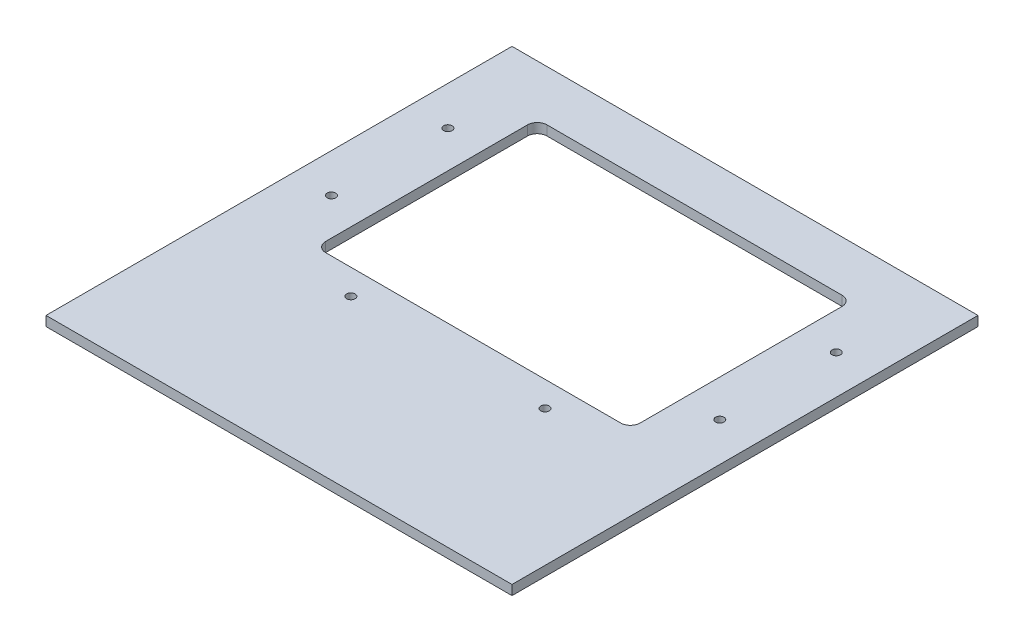
ISO-10303-21;
HEADER;
FILE_DESCRIPTION(('STEP AP214'),'2;1');
FILE_NAME('part.step','',(''),(''),'','','');
FILE_SCHEMA(('AUTOMOTIVE_DESIGN { 1 0 10303 214 1 1 1 1 }'));
ENDSEC;
DATA;
#1=APPLICATION_CONTEXT('core data for automotive mechanical design processes');
#2=APPLICATION_PROTOCOL_DEFINITION('international standard','automotive_design',2000,#1);
#3=PRODUCT_CONTEXT('',#1,'mechanical');
#4=PRODUCT('Part','Part','',(#3));
#5=PRODUCT_RELATED_PRODUCT_CATEGORY('part','',(#4));
#6=PRODUCT_DEFINITION_FORMATION('','',#4);
#7=PRODUCT_DEFINITION_CONTEXT('part definition',#1,'design');
#8=PRODUCT_DEFINITION('design','',#6,#7);
#9=PRODUCT_DEFINITION_SHAPE('','',#8);
#10=(LENGTH_UNIT() NAMED_UNIT(*) SI_UNIT(.MILLI.,.METRE.));
#11=(NAMED_UNIT(*) PLANE_ANGLE_UNIT() SI_UNIT($,.RADIAN.));
#12=(NAMED_UNIT(*) SI_UNIT($,.STERADIAN.) SOLID_ANGLE_UNIT());
#13=UNCERTAINTY_MEASURE_WITH_UNIT(LENGTH_MEASURE(1.E-05),#10,'distance_accuracy_value','');
#14=(GEOMETRIC_REPRESENTATION_CONTEXT(3) GLOBAL_UNCERTAINTY_ASSIGNED_CONTEXT((#13)) GLOBAL_UNIT_ASSIGNED_CONTEXT((#10,
#11,#12)) REPRESENTATION_CONTEXT('',''));
#15=CARTESIAN_POINT('',(0.,0.,0.));
#16=DIRECTION('',(0.,0.,1.));
#17=DIRECTION('',(1.,0.,0.));
#18=AXIS2_PLACEMENT_3D('',#15,#16,#17);
#19=CARTESIAN_POINT('',(0.,3.175,0.));
#20=DIRECTION('',(0.,1.,0.));
#21=DIRECTION('',(0.,0.,1.));
#22=AXIS2_PLACEMENT_3D('',#19,#20,#21);
#23=PLANE('',#22);
#24=CARTESIAN_POINT('',(-127.,3.175,-8.88999999999992));
#25=DIRECTION('',(0.,1.,0.));
#26=DIRECTION('',(0.,0.,1.));
#27=AXIS2_PLACEMENT_3D('',#24,#25,#26);
#28=CIRCLE('',#27,2.778125);
#29=CARTESIAN_POINT('',(-127.,3.175,-6.11187499999992));
#30=VERTEX_POINT('',#29);
#31=EDGE_CURVE('E322',#30,#30,#28,.T.);
#32=ORIENTED_EDGE('',*,*,#31,.F.);
#33=EDGE_LOOP('',(#32));
#34=FACE_BOUND('',#33,.T.);
#35=CARTESIAN_POINT('',(127.,3.175,-8.88999999999992));
#36=DIRECTION('',(0.,1.,0.));
#37=DIRECTION('',(0.,0.,1.));
#38=AXIS2_PLACEMENT_3D('',#35,#36,#37);
#39=CIRCLE('',#38,2.77812499999999);
#40=CARTESIAN_POINT('',(127.,3.175,-6.11187499999994));
#41=VERTEX_POINT('',#40);
#42=EDGE_CURVE('E334',#41,#41,#39,.T.);
#43=ORIENTED_EDGE('',*,*,#42,.F.);
#44=EDGE_LOOP('',(#43));
#45=FACE_BOUND('',#44,.T.);
#46=CARTESIAN_POINT('',(-63.5,3.175,41.9100000000001));
#47=DIRECTION('',(0.,1.,0.));
#48=DIRECTION('',(0.,0.,1.));
#49=AXIS2_PLACEMENT_3D('',#46,#47,#48);
#50=CIRCLE('',#49,2.778125);
#51=CARTESIAN_POINT('',(-63.5,3.175,44.6881250000001));
#52=VERTEX_POINT('',#51);
#53=EDGE_CURVE('E160',#52,#52,#50,.T.);
#54=ORIENTED_EDGE('',*,*,#53,.F.);
#55=EDGE_LOOP('',(#54));
#56=FACE_BOUND('',#55,.T.);
#57=DIRECTION('',(0.,0.,-1.));
#58=VECTOR('',#57,1.);
#59=CARTESIAN_POINT('',(152.4,3.175,-152.4));
#60=LINE('',#59,#58);
#61=CARTESIAN_POINT('',(152.4,3.175,152.4));
#62=VERTEX_POINT('',#61);
#63=CARTESIAN_POINT('',(152.4,3.175,-152.4));
#64=VERTEX_POINT('',#63);
#65=EDGE_CURVE('E190',#62,#64,#60,.T.);
#66=ORIENTED_EDGE('',*,*,#65,.T.);
#67=DIRECTION('',(-1.,0.,0.));
#68=VECTOR('',#67,1.);
#69=CARTESIAN_POINT('',(-152.4,3.175,-152.4));
#70=LINE('',#69,#68);
#71=CARTESIAN_POINT('',(-152.4,3.175,-152.4));
#72=VERTEX_POINT('',#71);
#73=EDGE_CURVE('E193',#64,#72,#70,.T.);
#74=ORIENTED_EDGE('',*,*,#73,.T.);
#75=DIRECTION('',(0.,0.,1.));
#76=VECTOR('',#75,1.);
#77=CARTESIAN_POINT('',(-152.4,3.175,-152.4));
#78=LINE('',#77,#76);
#79=CARTESIAN_POINT('',(-152.4,3.175,152.4));
#80=VERTEX_POINT('',#79);
#81=EDGE_CURVE('E196',#72,#80,#78,.T.);
#82=ORIENTED_EDGE('',*,*,#81,.T.);
#83=DIRECTION('',(1.,0.,0.));
#84=VECTOR('',#83,1.);
#85=CARTESIAN_POINT('',(-152.4,3.175,152.4));
#86=LINE('',#85,#84);
#87=EDGE_CURVE('E198',#80,#62,#86,.T.);
#88=ORIENTED_EDGE('',*,*,#87,.T.);
#89=EDGE_LOOP('',(#66,#74,#82,#88));
#90=FACE_BOUND('',#89,.T.);
#91=DIRECTION('',(1.,0.,0.));
#92=VECTOR('',#91,1.);
#93=CARTESIAN_POINT('',(-96.5112438893781,3.175,25.4000000000001));
#94=LINE('',#93,#92);
#95=CARTESIAN_POINT('',(-96.5112438893781,3.175,25.4000000000001));
#96=VERTEX_POINT('',#95);
#97=CARTESIAN_POINT('',(96.5112438893781,3.175,25.4000000000001));
#98=VERTEX_POINT('',#97);
#99=EDGE_CURVE('E130',#96,#98,#94,.T.);
#100=ORIENTED_EDGE('',*,*,#99,.F.);
#101=CARTESIAN_POINT('',(-96.511243889378,3.175,19.0500000000001));
#102=DIRECTION('',(0.,1.,0.));
#103=DIRECTION('',(0.,0.,1.));
#104=AXIS2_PLACEMENT_3D('',#101,#102,#103);
#105=CIRCLE('',#104,6.35000000000004);
#106=CARTESIAN_POINT('',(-102.861243889378,3.175,19.0500000000001));
#107=VERTEX_POINT('',#106);
#108=EDGE_CURVE('E122',#107,#96,#105,.T.);
#109=ORIENTED_EDGE('',*,*,#108,.F.);
#110=DIRECTION('',(0.,0.,1.));
#111=VECTOR('',#110,1.);
#112=CARTESIAN_POINT('',(-102.861243889378,3.175,-113.03));
#113=LINE('',#112,#111);
#114=CARTESIAN_POINT('',(-102.861243889378,3.175,-113.03));
#115=VERTEX_POINT('',#114);
#116=EDGE_CURVE('E157',#115,#107,#113,.T.);
#117=ORIENTED_EDGE('',*,*,#116,.F.);
#118=CARTESIAN_POINT('',(-96.511243889378,3.175,-113.03));
#119=DIRECTION('',(0.,1.,0.));
#120=DIRECTION('',(0.,0.,1.));
#121=AXIS2_PLACEMENT_3D('',#118,#119,#120);
#122=CIRCLE('',#121,6.35000000000004);
#123=CARTESIAN_POINT('',(-96.5112438893781,3.175,-119.38));
#124=VERTEX_POINT('',#123);
#125=EDGE_CURVE('E155',#124,#115,#122,.T.);
#126=ORIENTED_EDGE('',*,*,#125,.F.);
#127=DIRECTION('',(-1.,0.,0.));
#128=VECTOR('',#127,1.);
#129=CARTESIAN_POINT('',(-96.5112438893781,3.175,-119.38));
#130=LINE('',#129,#128);
#131=CARTESIAN_POINT('',(96.5112438893781,3.175,-119.38));
#132=VERTEX_POINT('',#131);
#133=EDGE_CURVE('E153',#132,#124,#130,.T.);
#134=ORIENTED_EDGE('',*,*,#133,.F.);
#135=CARTESIAN_POINT('',(96.511243889378,3.175,-113.03));
#136=DIRECTION('',(0.,1.,0.));
#137=DIRECTION('',(0.,0.,-1.));
#138=AXIS2_PLACEMENT_3D('',#135,#136,#137);
#139=CIRCLE('',#138,6.35000000000004);
#140=CARTESIAN_POINT('',(102.861243889378,3.175,-113.03));
#141=VERTEX_POINT('',#140);
#142=EDGE_CURVE('E151',#141,#132,#139,.T.);
#143=ORIENTED_EDGE('',*,*,#142,.F.);
#144=DIRECTION('',(0.,0.,-1.));
#145=VECTOR('',#144,1.);
#146=CARTESIAN_POINT('',(102.861243889378,3.175,-113.03));
#147=LINE('',#146,#145);
#148=CARTESIAN_POINT('',(102.861243889378,3.175,19.0500000000001));
#149=VERTEX_POINT('',#148);
#150=EDGE_CURVE('E146',#149,#141,#147,.T.);
#151=ORIENTED_EDGE('',*,*,#150,.F.);
#152=CARTESIAN_POINT('',(96.511243889378,3.175,19.0500000000001));
#153=DIRECTION('',(0.,1.,0.));
#154=DIRECTION('',(0.,0.,1.));
#155=AXIS2_PLACEMENT_3D('',#152,#153,#154);
#156=CIRCLE('',#155,6.35000000000005);
#157=EDGE_CURVE('E144',#98,#149,#156,.T.);
#158=ORIENTED_EDGE('',*,*,#157,.F.);
#159=EDGE_LOOP('',(#100,#109,#117,#126,#134,#143,#151,#158));
#160=FACE_BOUND('',#159,.T.);
#161=CARTESIAN_POINT('',(63.5,3.175,41.9100000000001));
#162=DIRECTION('',(0.,1.,0.));
#163=DIRECTION('',(0.,0.,1.));
#164=AXIS2_PLACEMENT_3D('',#161,#162,#163);
#165=CIRCLE('',#164,2.778125);
#166=CARTESIAN_POINT('',(63.5,3.175,44.6881250000001));
#167=VERTEX_POINT('',#166);
#168=EDGE_CURVE('E340',#167,#167,#165,.T.);
#169=ORIENTED_EDGE('',*,*,#168,.F.);
#170=EDGE_LOOP('',(#169));
#171=FACE_BOUND('',#170,.T.);
#172=CARTESIAN_POINT('',(127.,3.175,-85.0899999999999));
#173=DIRECTION('',(0.,1.,0.));
#174=DIRECTION('',(0.,0.,1.));
#175=AXIS2_PLACEMENT_3D('',#172,#173,#174);
#176=CIRCLE('',#175,2.77812499999999);
#177=CARTESIAN_POINT('',(127.,3.175,-82.3118749999999));
#178=VERTEX_POINT('',#177);
#179=EDGE_CURVE('E328',#178,#178,#176,.T.);
#180=ORIENTED_EDGE('',*,*,#179,.F.);
#181=EDGE_LOOP('',(#180));
#182=FACE_BOUND('',#181,.T.);
#183=CARTESIAN_POINT('',(-127.,3.175,-85.0899999999999));
#184=DIRECTION('',(0.,1.,0.));
#185=DIRECTION('',(0.,0.,1.));
#186=AXIS2_PLACEMENT_3D('',#183,#184,#185);
#187=CIRCLE('',#186,2.778125);
#188=CARTESIAN_POINT('',(-127.,3.175,-82.3118749999999));
#189=VERTEX_POINT('',#188);
#190=EDGE_CURVE('E313',#189,#189,#187,.T.);
#191=ORIENTED_EDGE('',*,*,#190,.F.);
#192=EDGE_LOOP('',(#191));
#193=FACE_BOUND('',#192,.T.);
#194=ADVANCED_FACE('F33',(#34,#45,#56,#90,#160,#171,#182,#193),#23,.T.);
#195=CARTESIAN_POINT('',(0.,-3.175,0.));
#196=DIRECTION('',(0.,1.,0.));
#197=DIRECTION('',(0.,0.,1.));
#198=AXIS2_PLACEMENT_3D('',#195,#196,#197);
#199=PLANE('',#198);
#200=DIRECTION('',(0.,0.,-1.));
#201=VECTOR('',#200,1.);
#202=CARTESIAN_POINT('',(152.4,-3.175,-152.4));
#203=LINE('',#202,#201);
#204=CARTESIAN_POINT('',(152.4,-3.175,152.4));
#205=VERTEX_POINT('',#204);
#206=CARTESIAN_POINT('',(152.4,-3.175,-152.4));
#207=VERTEX_POINT('',#206);
#208=EDGE_CURVE('E138',#205,#207,#203,.T.);
#209=ORIENTED_EDGE('',*,*,#208,.F.);
#210=DIRECTION('',(1.,0.,0.));
#211=VECTOR('',#210,1.);
#212=CARTESIAN_POINT('',(-152.4,-3.175,152.4));
#213=LINE('',#212,#211);
#214=CARTESIAN_POINT('',(-152.4,-3.175,152.4));
#215=VERTEX_POINT('',#214);
#216=EDGE_CURVE('E194',#215,#205,#213,.T.);
#217=ORIENTED_EDGE('',*,*,#216,.F.);
#218=DIRECTION('',(0.,0.,1.));
#219=VECTOR('',#218,1.);
#220=CARTESIAN_POINT('',(-152.4,-3.175,-152.4));
#221=LINE('',#220,#219);
#222=CARTESIAN_POINT('',(-152.4,-3.175,-152.4));
#223=VERTEX_POINT('',#222);
#224=EDGE_CURVE('E205',#223,#215,#221,.T.);
#225=ORIENTED_EDGE('',*,*,#224,.F.);
#226=DIRECTION('',(-1.,0.,0.));
#227=VECTOR('',#226,1.);
#228=CARTESIAN_POINT('',(-152.4,-3.175,-152.4));
#229=LINE('',#228,#227);
#230=EDGE_CURVE('E203',#207,#223,#229,.T.);
#231=ORIENTED_EDGE('',*,*,#230,.F.);
#232=EDGE_LOOP('',(#209,#217,#225,#231));
#233=FACE_BOUND('',#232,.T.);
#234=CARTESIAN_POINT('',(-96.511243889378,-3.175,19.0500000000001));
#235=DIRECTION('',(0.,1.,0.));
#236=DIRECTION('',(0.,0.,1.));
#237=AXIS2_PLACEMENT_3D('',#234,#235,#236);
#238=CIRCLE('',#237,6.35000000000004);
#239=CARTESIAN_POINT('',(-102.861243889378,-3.175,19.0500000000001));
#240=VERTEX_POINT('',#239);
#241=CARTESIAN_POINT('',(-96.5112438893781,-3.175,25.4000000000001));
#242=VERTEX_POINT('',#241);
#243=EDGE_CURVE('E56',#240,#242,#238,.T.);
#244=ORIENTED_EDGE('',*,*,#243,.T.);
#245=DIRECTION('',(1.,0.,0.));
#246=VECTOR('',#245,1.);
#247=CARTESIAN_POINT('',(-96.5112438893781,-3.175,25.4000000000001));
#248=LINE('',#247,#246);
#249=CARTESIAN_POINT('',(96.5112438893781,-3.175,25.4000000000001));
#250=VERTEX_POINT('',#249);
#251=EDGE_CURVE('E137',#242,#250,#248,.T.);
#252=ORIENTED_EDGE('',*,*,#251,.T.);
#253=CARTESIAN_POINT('',(96.511243889378,-3.175,19.0500000000001));
#254=DIRECTION('',(0.,1.,0.));
#255=DIRECTION('',(0.,0.,1.));
#256=AXIS2_PLACEMENT_3D('',#253,#254,#255);
#257=CIRCLE('',#256,6.35000000000005);
#258=CARTESIAN_POINT('',(102.861243889378,-3.175,19.0500000000001));
#259=VERTEX_POINT('',#258);
#260=EDGE_CURVE('E162',#250,#259,#257,.T.);
#261=ORIENTED_EDGE('',*,*,#260,.T.);
#262=DIRECTION('',(0.,0.,-1.));
#263=VECTOR('',#262,1.);
#264=CARTESIAN_POINT('',(102.861243889378,-3.175,-113.03));
#265=LINE('',#264,#263);
#266=CARTESIAN_POINT('',(102.861243889378,-3.175,-113.03));
#267=VERTEX_POINT('',#266);
#268=EDGE_CURVE('E165',#259,#267,#265,.T.);
#269=ORIENTED_EDGE('',*,*,#268,.T.);
#270=CARTESIAN_POINT('',(96.511243889378,-3.175,-113.03));
#271=DIRECTION('',(0.,1.,0.));
#272=DIRECTION('',(0.,0.,-1.));
#273=AXIS2_PLACEMENT_3D('',#270,#271,#272);
#274=CIRCLE('',#273,6.35000000000004);
#275=CARTESIAN_POINT('',(96.5112438893781,-3.175,-119.38));
#276=VERTEX_POINT('',#275);
#277=EDGE_CURVE('E168',#267,#276,#274,.T.);
#278=ORIENTED_EDGE('',*,*,#277,.T.);
#279=DIRECTION('',(-1.,0.,0.));
#280=VECTOR('',#279,1.);
#281=CARTESIAN_POINT('',(-96.5112438893781,-3.175,-119.38));
#282=LINE('',#281,#280);
#283=CARTESIAN_POINT('',(-96.5112438893781,-3.175,-119.38));
#284=VERTEX_POINT('',#283);
#285=EDGE_CURVE('E171',#276,#284,#282,.T.);
#286=ORIENTED_EDGE('',*,*,#285,.T.);
#287=CARTESIAN_POINT('',(-96.511243889378,-3.175,-113.03));
#288=DIRECTION('',(0.,1.,0.));
#289=DIRECTION('',(0.,0.,1.));
#290=AXIS2_PLACEMENT_3D('',#287,#288,#289);
#291=CIRCLE('',#290,6.35000000000004);
#292=CARTESIAN_POINT('',(-102.861243889378,-3.175,-113.03));
#293=VERTEX_POINT('',#292);
#294=EDGE_CURVE('E174',#284,#293,#291,.T.);
#295=ORIENTED_EDGE('',*,*,#294,.T.);
#296=DIRECTION('',(0.,0.,1.));
#297=VECTOR('',#296,1.);
#298=CARTESIAN_POINT('',(-102.861243889378,-3.175,-113.03));
#299=LINE('',#298,#297);
#300=EDGE_CURVE('E131',#293,#240,#299,.T.);
#301=ORIENTED_EDGE('',*,*,#300,.T.);
#302=EDGE_LOOP('',(#244,#252,#261,#269,#278,#286,#295,#301));
#303=FACE_BOUND('',#302,.T.);
#304=CARTESIAN_POINT('',(-63.5,-3.175,41.9100000000001));
#305=DIRECTION('',(0.,1.,0.));
#306=DIRECTION('',(0.,0.,1.));
#307=AXIS2_PLACEMENT_3D('',#304,#305,#306);
#308=CIRCLE('',#307,2.778125);
#309=CARTESIAN_POINT('',(-63.5,-3.175,44.6881250000001));
#310=VERTEX_POINT('',#309);
#311=EDGE_CURVE('E343',#310,#310,#308,.T.);
#312=ORIENTED_EDGE('',*,*,#311,.T.);
#313=EDGE_LOOP('',(#312));
#314=FACE_BOUND('',#313,.T.);
#315=CARTESIAN_POINT('',(63.5,-3.175,41.9100000000001));
#316=DIRECTION('',(0.,1.,0.));
#317=DIRECTION('',(0.,0.,1.));
#318=AXIS2_PLACEMENT_3D('',#315,#316,#317);
#319=CIRCLE('',#318,2.778125);
#320=CARTESIAN_POINT('',(63.5,-3.175,44.6881250000001));
#321=VERTEX_POINT('',#320);
#322=EDGE_CURVE('E337',#321,#321,#319,.T.);
#323=ORIENTED_EDGE('',*,*,#322,.T.);
#324=EDGE_LOOP('',(#323));
#325=FACE_BOUND('',#324,.T.);
#326=CARTESIAN_POINT('',(127.,-3.175,-8.88999999999992));
#327=DIRECTION('',(0.,1.,0.));
#328=DIRECTION('',(0.,0.,1.));
#329=AXIS2_PLACEMENT_3D('',#326,#327,#328);
#330=CIRCLE('',#329,2.77812499999999);
#331=CARTESIAN_POINT('',(127.,-3.175,-6.11187499999994));
#332=VERTEX_POINT('',#331);
#333=EDGE_CURVE('E331',#332,#332,#330,.T.);
#334=ORIENTED_EDGE('',*,*,#333,.T.);
#335=EDGE_LOOP('',(#334));
#336=FACE_BOUND('',#335,.T.);
#337=CARTESIAN_POINT('',(127.,-3.175,-85.0899999999999));
#338=DIRECTION('',(0.,1.,0.));
#339=DIRECTION('',(0.,0.,1.));
#340=AXIS2_PLACEMENT_3D('',#337,#338,#339);
#341=CIRCLE('',#340,2.77812499999999);
#342=CARTESIAN_POINT('',(127.,-3.175,-82.3118749999999));
#343=VERTEX_POINT('',#342);
#344=EDGE_CURVE('E325',#343,#343,#341,.T.);
#345=ORIENTED_EDGE('',*,*,#344,.T.);
#346=EDGE_LOOP('',(#345));
#347=FACE_BOUND('',#346,.T.);
#348=CARTESIAN_POINT('',(-127.,-3.175,-8.88999999999992));
#349=DIRECTION('',(0.,1.,0.));
#350=DIRECTION('',(0.,0.,1.));
#351=AXIS2_PLACEMENT_3D('',#348,#349,#350);
#352=CIRCLE('',#351,2.778125);
#353=CARTESIAN_POINT('',(-127.,-3.175,-6.11187499999992));
#354=VERTEX_POINT('',#353);
#355=EDGE_CURVE('E319',#354,#354,#352,.T.);
#356=ORIENTED_EDGE('',*,*,#355,.T.);
#357=EDGE_LOOP('',(#356));
#358=FACE_BOUND('',#357,.T.);
#359=CARTESIAN_POINT('',(-127.,-3.175,-85.0899999999999));
#360=DIRECTION('',(0.,1.,0.));
#361=DIRECTION('',(0.,0.,1.));
#362=AXIS2_PLACEMENT_3D('',#359,#360,#361);
#363=CIRCLE('',#362,2.778125);
#364=CARTESIAN_POINT('',(-127.,-3.175,-82.3118749999999));
#365=VERTEX_POINT('',#364);
#366=EDGE_CURVE('E316',#365,#365,#363,.T.);
#367=ORIENTED_EDGE('',*,*,#366,.T.);
#368=EDGE_LOOP('',(#367));
#369=FACE_BOUND('',#368,.T.);
#370=ADVANCED_FACE('F223',(#233,#303,#314,#325,#336,#347,#358,#369),#199,.F.);
#371=CARTESIAN_POINT('',(152.4,3.175,-152.4));
#372=DIRECTION('',(-1.,0.,0.));
#373=DIRECTION('',(0.,0.,1.));
#374=AXIS2_PLACEMENT_3D('',#371,#372,#373);
#375=PLANE('',#374);
#376=ORIENTED_EDGE('',*,*,#208,.T.);
#377=DIRECTION('',(0.,-1.,0.));
#378=VECTOR('',#377,1.);
#379=CARTESIAN_POINT('',(152.4,3.175,-152.4));
#380=LINE('',#379,#378);
#381=EDGE_CURVE('E11',#64,#207,#380,.T.);
#382=ORIENTED_EDGE('',*,*,#381,.F.);
#383=ORIENTED_EDGE('',*,*,#65,.F.);
#384=DIRECTION('',(0.,-1.,0.));
#385=VECTOR('',#384,1.);
#386=CARTESIAN_POINT('',(152.4,3.175,152.4));
#387=LINE('',#386,#385);
#388=EDGE_CURVE('E200',#62,#205,#387,.T.);
#389=ORIENTED_EDGE('',*,*,#388,.T.);
#390=EDGE_LOOP('',(#376,#382,#383,#389));
#391=FACE_BOUND('',#390,.T.);
#392=ADVANCED_FACE('F35',(#391),#375,.F.);
#393=CARTESIAN_POINT('',(-152.4,3.175,-152.4));
#394=DIRECTION('',(0.,0.,1.));
#395=DIRECTION('',(1.,0.,0.));
#396=AXIS2_PLACEMENT_3D('',#393,#394,#395);
#397=PLANE('',#396);
#398=ORIENTED_EDGE('',*,*,#230,.T.);
#399=DIRECTION('',(0.,-1.,0.));
#400=VECTOR('',#399,1.);
#401=CARTESIAN_POINT('',(-152.4,3.175,-152.4));
#402=LINE('',#401,#400);
#403=EDGE_CURVE('E41',#72,#223,#402,.T.);
#404=ORIENTED_EDGE('',*,*,#403,.F.);
#405=ORIENTED_EDGE('',*,*,#73,.F.);
#406=ORIENTED_EDGE('',*,*,#381,.T.);
#407=EDGE_LOOP('',(#398,#404,#405,#406));
#408=FACE_BOUND('',#407,.T.);
#409=ADVANCED_FACE('F233',(#408),#397,.F.);
#410=CARTESIAN_POINT('',(-152.4,3.175,-152.4));
#411=DIRECTION('',(1.,0.,0.));
#412=DIRECTION('',(0.,0.,-1.));
#413=AXIS2_PLACEMENT_3D('',#410,#411,#412);
#414=PLANE('',#413);
#415=ORIENTED_EDGE('',*,*,#224,.T.);
#416=DIRECTION('',(0.,-1.,0.));
#417=VECTOR('',#416,1.);
#418=CARTESIAN_POINT('',(-152.4,3.175,152.4));
#419=LINE('',#418,#417);
#420=EDGE_CURVE('E210',#80,#215,#419,.T.);
#421=ORIENTED_EDGE('',*,*,#420,.F.);
#422=ORIENTED_EDGE('',*,*,#81,.F.);
#423=ORIENTED_EDGE('',*,*,#403,.T.);
#424=EDGE_LOOP('',(#415,#421,#422,#423));
#425=FACE_BOUND('',#424,.T.);
#426=ADVANCED_FACE('F217',(#425),#414,.F.);
#427=CARTESIAN_POINT('',(-152.4,3.175,152.4));
#428=DIRECTION('',(0.,0.,-1.));
#429=DIRECTION('',(-1.,0.,0.));
#430=AXIS2_PLACEMENT_3D('',#427,#428,#429);
#431=PLANE('',#430);
#432=ORIENTED_EDGE('',*,*,#216,.T.);
#433=ORIENTED_EDGE('',*,*,#388,.F.);
#434=ORIENTED_EDGE('',*,*,#87,.F.);
#435=ORIENTED_EDGE('',*,*,#420,.T.);
#436=EDGE_LOOP('',(#432,#433,#434,#435));
#437=FACE_BOUND('',#436,.T.);
#438=ADVANCED_FACE('F227',(#437),#431,.F.);
#439=CARTESIAN_POINT('',(-96.511243889378,3.175,19.0500000000001));
#440=DIRECTION('',(0.,-1.,0.));
#441=DIRECTION('',(0.,0.,-1.));
#442=AXIS2_PLACEMENT_3D('',#439,#440,#441);
#443=CYLINDRICAL_SURFACE('',#442,6.35000000000004);
#444=ORIENTED_EDGE('',*,*,#243,.F.);
#445=DIRECTION('',(0.,-1.,0.));
#446=VECTOR('',#445,1.);
#447=CARTESIAN_POINT('',(-102.861243889378,3.175,19.0500000000001));
#448=LINE('',#447,#446);
#449=EDGE_CURVE('E126',#107,#240,#448,.T.);
#450=ORIENTED_EDGE('',*,*,#449,.F.);
#451=ORIENTED_EDGE('',*,*,#108,.T.);
#452=DIRECTION('',(0.,-1.,0.));
#453=VECTOR('',#452,1.);
#454=CARTESIAN_POINT('',(-96.5112438893781,3.175,25.4000000000001));
#455=LINE('',#454,#453);
#456=EDGE_CURVE('E125',#96,#242,#455,.T.);
#457=ORIENTED_EDGE('',*,*,#456,.T.);
#458=EDGE_LOOP('',(#444,#450,#451,#457));
#459=FACE_BOUND('',#458,.T.);
#460=ADVANCED_FACE('F124',(#459),#443,.F.);
#461=CARTESIAN_POINT('',(-96.5112438893781,3.175,25.4000000000001));
#462=DIRECTION('',(0.,0.,-1.));
#463=DIRECTION('',(-1.,0.,0.));
#464=AXIS2_PLACEMENT_3D('',#461,#462,#463);
#465=PLANE('',#464);
#466=ORIENTED_EDGE('',*,*,#251,.F.);
#467=ORIENTED_EDGE('',*,*,#456,.F.);
#468=ORIENTED_EDGE('',*,*,#99,.T.);
#469=DIRECTION('',(0.,-1.,0.));
#470=VECTOR('',#469,1.);
#471=CARTESIAN_POINT('',(96.5112438893781,3.175,25.4000000000001));
#472=LINE('',#471,#470);
#473=EDGE_CURVE('E139',#98,#250,#472,.T.);
#474=ORIENTED_EDGE('',*,*,#473,.T.);
#475=EDGE_LOOP('',(#466,#467,#468,#474));
#476=FACE_BOUND('',#475,.T.);
#477=ADVANCED_FACE('F134',(#476),#465,.T.);
#478=CARTESIAN_POINT('',(96.511243889378,3.175,19.0500000000001));
#479=DIRECTION('',(0.,-1.,0.));
#480=DIRECTION('',(0.,0.,-1.));
#481=AXIS2_PLACEMENT_3D('',#478,#479,#480);
#482=CYLINDRICAL_SURFACE('',#481,6.35000000000005);
#483=ORIENTED_EDGE('',*,*,#260,.F.);
#484=ORIENTED_EDGE('',*,*,#473,.F.);
#485=ORIENTED_EDGE('',*,*,#157,.T.);
#486=DIRECTION('',(0.,-1.,0.));
#487=VECTOR('',#486,1.);
#488=CARTESIAN_POINT('',(102.861243889378,3.175,19.0500000000001));
#489=LINE('',#488,#487);
#490=EDGE_CURVE('E187',#149,#259,#489,.T.);
#491=ORIENTED_EDGE('',*,*,#490,.T.);
#492=EDGE_LOOP('',(#483,#484,#485,#491));
#493=FACE_BOUND('',#492,.T.);
#494=ADVANCED_FACE('F259',(#493),#482,.F.);
#495=CARTESIAN_POINT('',(102.861243889378,3.175,-113.03));
#496=DIRECTION('',(-1.,0.,0.));
#497=DIRECTION('',(0.,0.,1.));
#498=AXIS2_PLACEMENT_3D('',#495,#496,#497);
#499=PLANE('',#498);
#500=ORIENTED_EDGE('',*,*,#268,.F.);
#501=ORIENTED_EDGE('',*,*,#490,.F.);
#502=ORIENTED_EDGE('',*,*,#150,.T.);
#503=DIRECTION('',(0.,-1.,0.));
#504=VECTOR('',#503,1.);
#505=CARTESIAN_POINT('',(102.861243889378,3.175,-113.03));
#506=LINE('',#505,#504);
#507=EDGE_CURVE('E185',#141,#267,#506,.T.);
#508=ORIENTED_EDGE('',*,*,#507,.T.);
#509=EDGE_LOOP('',(#500,#501,#502,#508));
#510=FACE_BOUND('',#509,.T.);
#511=ADVANCED_FACE('F263',(#510),#499,.T.);
#512=CARTESIAN_POINT('',(96.511243889378,3.175,-113.03));
#513=DIRECTION('',(0.,-1.,0.));
#514=DIRECTION('',(0.,0.,-1.));
#515=AXIS2_PLACEMENT_3D('',#512,#513,#514);
#516=CYLINDRICAL_SURFACE('',#515,6.35000000000004);
#517=ORIENTED_EDGE('',*,*,#277,.F.);
#518=ORIENTED_EDGE('',*,*,#507,.F.);
#519=ORIENTED_EDGE('',*,*,#142,.T.);
#520=DIRECTION('',(0.,-1.,0.));
#521=VECTOR('',#520,1.);
#522=CARTESIAN_POINT('',(96.5112438893781,3.175,-119.38));
#523=LINE('',#522,#521);
#524=EDGE_CURVE('E183',#132,#276,#523,.T.);
#525=ORIENTED_EDGE('',*,*,#524,.T.);
#526=EDGE_LOOP('',(#517,#518,#519,#525));
#527=FACE_BOUND('',#526,.T.);
#528=ADVANCED_FACE('F269',(#527),#516,.F.);
#529=CARTESIAN_POINT('',(-96.5112438893781,3.175,-119.38));
#530=DIRECTION('',(0.,0.,1.));
#531=DIRECTION('',(1.,0.,0.));
#532=AXIS2_PLACEMENT_3D('',#529,#530,#531);
#533=PLANE('',#532);
#534=ORIENTED_EDGE('',*,*,#285,.F.);
#535=ORIENTED_EDGE('',*,*,#524,.F.);
#536=ORIENTED_EDGE('',*,*,#133,.T.);
#537=DIRECTION('',(0.,-1.,0.));
#538=VECTOR('',#537,1.);
#539=CARTESIAN_POINT('',(-96.5112438893781,3.175,-119.38));
#540=LINE('',#539,#538);
#541=EDGE_CURVE('E181',#124,#284,#540,.T.);
#542=ORIENTED_EDGE('',*,*,#541,.T.);
#543=EDGE_LOOP('',(#534,#535,#536,#542));
#544=FACE_BOUND('',#543,.T.);
#545=ADVANCED_FACE('F273',(#544),#533,.T.);
#546=CARTESIAN_POINT('',(-96.511243889378,3.175,-113.03));
#547=DIRECTION('',(0.,-1.,0.));
#548=DIRECTION('',(0.,0.,-1.));
#549=AXIS2_PLACEMENT_3D('',#546,#547,#548);
#550=CYLINDRICAL_SURFACE('',#549,6.35000000000004);
#551=ORIENTED_EDGE('',*,*,#294,.F.);
#552=ORIENTED_EDGE('',*,*,#541,.F.);
#553=ORIENTED_EDGE('',*,*,#125,.T.);
#554=DIRECTION('',(0.,-1.,0.));
#555=VECTOR('',#554,1.);
#556=CARTESIAN_POINT('',(-102.861243889378,3.175,-113.03));
#557=LINE('',#556,#555);
#558=EDGE_CURVE('E48',#115,#293,#557,.T.);
#559=ORIENTED_EDGE('',*,*,#558,.T.);
#560=EDGE_LOOP('',(#551,#552,#553,#559));
#561=FACE_BOUND('',#560,.T.);
#562=ADVANCED_FACE('F277',(#561),#550,.F.);
#563=CARTESIAN_POINT('',(-102.861243889378,3.175,-113.03));
#564=DIRECTION('',(1.,0.,0.));
#565=DIRECTION('',(0.,0.,-1.));
#566=AXIS2_PLACEMENT_3D('',#563,#564,#565);
#567=PLANE('',#566);
#568=ORIENTED_EDGE('',*,*,#300,.F.);
#569=ORIENTED_EDGE('',*,*,#558,.F.);
#570=ORIENTED_EDGE('',*,*,#116,.T.);
#571=ORIENTED_EDGE('',*,*,#449,.T.);
#572=EDGE_LOOP('',(#568,#569,#570,#571));
#573=FACE_BOUND('',#572,.T.);
#574=ADVANCED_FACE('F281',(#573),#567,.T.);
#575=CARTESIAN_POINT('',(-63.5,3.175,41.9100000000001));
#576=DIRECTION('',(0.,-1.,0.));
#577=DIRECTION('',(0.,0.,-1.));
#578=AXIS2_PLACEMENT_3D('',#575,#576,#577);
#579=CYLINDRICAL_SURFACE('',#578,2.778125);
#580=ORIENTED_EDGE('',*,*,#53,.T.);
#581=EDGE_LOOP('',(#580));
#582=FACE_BOUND('',#581,.T.);
#583=ORIENTED_EDGE('',*,*,#311,.F.);
#584=EDGE_LOOP('',(#583));
#585=FACE_BOUND('',#584,.T.);
#586=ADVANCED_FACE('F285',(#582,#585),#579,.F.);
#587=CARTESIAN_POINT('',(63.5,3.175,41.9100000000001));
#588=DIRECTION('',(0.,-1.,0.));
#589=DIRECTION('',(0.,0.,-1.));
#590=AXIS2_PLACEMENT_3D('',#587,#588,#589);
#591=CYLINDRICAL_SURFACE('',#590,2.778125);
#592=ORIENTED_EDGE('',*,*,#168,.T.);
#593=EDGE_LOOP('',(#592));
#594=FACE_BOUND('',#593,.T.);
#595=ORIENTED_EDGE('',*,*,#322,.F.);
#596=EDGE_LOOP('',(#595));
#597=FACE_BOUND('',#596,.T.);
#598=ADVANCED_FACE('F288',(#594,#597),#591,.F.);
#599=CARTESIAN_POINT('',(127.,3.175,-8.88999999999992));
#600=DIRECTION('',(0.,-1.,0.));
#601=DIRECTION('',(0.,0.,-1.));
#602=AXIS2_PLACEMENT_3D('',#599,#600,#601);
#603=CYLINDRICAL_SURFACE('',#602,2.77812499999999);
#604=ORIENTED_EDGE('',*,*,#42,.T.);
#605=EDGE_LOOP('',(#604));
#606=FACE_BOUND('',#605,.T.);
#607=ORIENTED_EDGE('',*,*,#333,.F.);
#608=EDGE_LOOP('',(#607));
#609=FACE_BOUND('',#608,.T.);
#610=ADVANCED_FACE('F292',(#606,#609),#603,.F.);
#611=CARTESIAN_POINT('',(127.,3.175,-85.0899999999999));
#612=DIRECTION('',(0.,-1.,0.));
#613=DIRECTION('',(0.,0.,-1.));
#614=AXIS2_PLACEMENT_3D('',#611,#612,#613);
#615=CYLINDRICAL_SURFACE('',#614,2.77812499999999);
#616=ORIENTED_EDGE('',*,*,#179,.T.);
#617=EDGE_LOOP('',(#616));
#618=FACE_BOUND('',#617,.T.);
#619=ORIENTED_EDGE('',*,*,#344,.F.);
#620=EDGE_LOOP('',(#619));
#621=FACE_BOUND('',#620,.T.);
#622=ADVANCED_FACE('F296',(#618,#621),#615,.F.);
#623=CARTESIAN_POINT('',(-127.,3.175,-8.88999999999992));
#624=DIRECTION('',(0.,-1.,0.));
#625=DIRECTION('',(0.,0.,-1.));
#626=AXIS2_PLACEMENT_3D('',#623,#624,#625);
#627=CYLINDRICAL_SURFACE('',#626,2.778125);
#628=ORIENTED_EDGE('',*,*,#31,.T.);
#629=EDGE_LOOP('',(#628));
#630=FACE_BOUND('',#629,.T.);
#631=ORIENTED_EDGE('',*,*,#355,.F.);
#632=EDGE_LOOP('',(#631));
#633=FACE_BOUND('',#632,.T.);
#634=ADVANCED_FACE('F300',(#630,#633),#627,.F.);
#635=CARTESIAN_POINT('',(-127.,3.175,-85.0899999999999));
#636=DIRECTION('',(0.,-1.,0.));
#637=DIRECTION('',(0.,0.,-1.));
#638=AXIS2_PLACEMENT_3D('',#635,#636,#637);
#639=CYLINDRICAL_SURFACE('',#638,2.778125);
#640=ORIENTED_EDGE('',*,*,#190,.T.);
#641=EDGE_LOOP('',(#640));
#642=FACE_BOUND('',#641,.T.);
#643=ORIENTED_EDGE('',*,*,#366,.F.);
#644=EDGE_LOOP('',(#643));
#645=FACE_BOUND('',#644,.T.);
#646=ADVANCED_FACE('F304',(#642,#645),#639,.F.);
#647=CLOSED_SHELL('',(#194,#370,#392,#409,#426,#438,#460,#477,#494,#511,#528,#545,#562,#574,
#586,#598,#610,#622,#634,#646));
#648=MANIFOLD_SOLID_BREP('B2',#647);
#649=ADVANCED_BREP_SHAPE_REPRESENTATION('',(#18,#648),#14);
#650=SHAPE_DEFINITION_REPRESENTATION(#9,#649);
ENDSEC;
END-ISO-10303-21;
